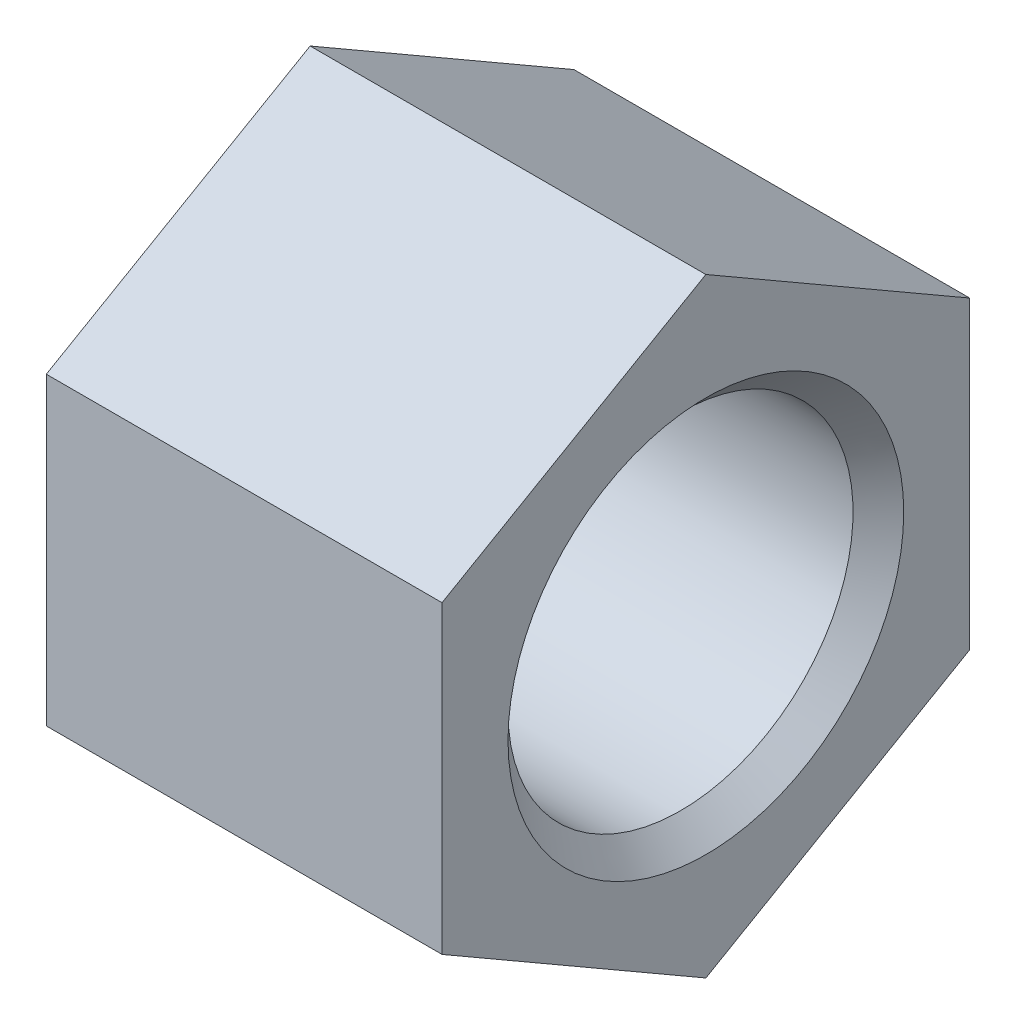
ISO-10303-21;
HEADER;
FILE_DESCRIPTION(('STEP AP214'),'2;1');
FILE_NAME('part.step','',(''),(''),'','','');
FILE_SCHEMA(('AUTOMOTIVE_DESIGN { 1 0 10303 214 1 1 1 1 }'));
ENDSEC;
DATA;
#1=APPLICATION_CONTEXT('core data for automotive mechanical design processes');
#2=APPLICATION_PROTOCOL_DEFINITION('international standard','automotive_design',2000,#1);
#3=PRODUCT_CONTEXT('',#1,'mechanical');
#4=PRODUCT('Part','Part','',(#3));
#5=PRODUCT_RELATED_PRODUCT_CATEGORY('part','',(#4));
#6=PRODUCT_DEFINITION_FORMATION('','',#4);
#7=PRODUCT_DEFINITION_CONTEXT('part definition',#1,'design');
#8=PRODUCT_DEFINITION('design','',#6,#7);
#9=PRODUCT_DEFINITION_SHAPE('','',#8);
#10=(LENGTH_UNIT() NAMED_UNIT(*) SI_UNIT(.MILLI.,.METRE.));
#11=(NAMED_UNIT(*) PLANE_ANGLE_UNIT() SI_UNIT($,.RADIAN.));
#12=(NAMED_UNIT(*) SI_UNIT($,.STERADIAN.) SOLID_ANGLE_UNIT());
#13=UNCERTAINTY_MEASURE_WITH_UNIT(LENGTH_MEASURE(1.E-05),#10,'distance_accuracy_value','');
#14=(GEOMETRIC_REPRESENTATION_CONTEXT(3) GLOBAL_UNCERTAINTY_ASSIGNED_CONTEXT((#13)) GLOBAL_UNIT_ASSIGNED_CONTEXT((#10,
#11,#12)) REPRESENTATION_CONTEXT('',''));
#15=CARTESIAN_POINT('',(0.,0.,0.));
#16=DIRECTION('',(0.,0.,1.));
#17=DIRECTION('',(1.,0.,0.));
#18=AXIS2_PLACEMENT_3D('',#15,#16,#17);
#19=CARTESIAN_POINT('',(0.,19.5,0.));
#20=DIRECTION('',(1.,0.,0.));
#21=DIRECTION('',(0.,0.,-1.));
#22=AXIS2_PLACEMENT_3D('',#19,#20,#21);
#23=PLANE('',#22);
#24=CARTESIAN_POINT('',(0.,0.,0.));
#25=DIRECTION('',(-1.,0.,0.));
#26=DIRECTION('',(0.,0.,1.));
#27=AXIS2_PLACEMENT_3D('',#24,#25,#26);
#28=CIRCLE('',#27,6.5);
#29=CARTESIAN_POINT('',(0.,0.,6.5));
#30=VERTEX_POINT('',#29);
#31=EDGE_CURVE('E157',#30,#30,#28,.T.);
#32=ORIENTED_EDGE('',*,*,#31,.F.);
#33=EDGE_LOOP('',(#32));
#34=FACE_BOUND('',#33,.T.);
#35=DIRECTION('',(0.,-0.5,-0.866025403784439));
#36=VECTOR('',#35,1.);
#37=CARTESIAN_POINT('',(0.,11.5470053837925,-20.));
#38=LINE('',#37,#36);
#39=CARTESIAN_POINT('',(0.,23.094010767585,0.));
#40=VERTEX_POINT('',#39);
#41=CARTESIAN_POINT('',(0.,11.5470053837925,-20.));
#42=VERTEX_POINT('',#41);
#43=EDGE_CURVE('E105',#40,#42,#38,.T.);
#44=ORIENTED_EDGE('',*,*,#43,.T.);
#45=DIRECTION('',(0.,-1.,0.));
#46=VECTOR('',#45,1.);
#47=CARTESIAN_POINT('',(0.,-11.5470053837925,-20.));
#48=LINE('',#47,#46);
#49=CARTESIAN_POINT('',(0.,-11.5470053837925,-20.));
#50=VERTEX_POINT('',#49);
#51=EDGE_CURVE('E219',#42,#50,#48,.T.);
#52=ORIENTED_EDGE('',*,*,#51,.T.);
#53=DIRECTION('',(0.,-0.5,0.866025403784439));
#54=VECTOR('',#53,1.);
#55=CARTESIAN_POINT('',(0.,-23.094010767585,0.));
#56=LINE('',#55,#54);
#57=CARTESIAN_POINT('',(0.,-23.094010767585,0.));
#58=VERTEX_POINT('',#57);
#59=EDGE_CURVE('E221',#50,#58,#56,.T.);
#60=ORIENTED_EDGE('',*,*,#59,.T.);
#61=DIRECTION('',(0.,0.5,0.866025403784439));
#62=VECTOR('',#61,1.);
#63=CARTESIAN_POINT('',(0.,-11.5470053837925,20.));
#64=LINE('',#63,#62);
#65=CARTESIAN_POINT('',(0.,-11.5470053837925,20.));
#66=VERTEX_POINT('',#65);
#67=EDGE_CURVE('E65',#58,#66,#64,.T.);
#68=ORIENTED_EDGE('',*,*,#67,.T.);
#69=DIRECTION('',(0.,1.,0.));
#70=VECTOR('',#69,1.);
#71=CARTESIAN_POINT('',(0.,11.5470053837925,20.));
#72=LINE('',#71,#70);
#73=CARTESIAN_POINT('',(0.,11.5470053837925,20.));
#74=VERTEX_POINT('',#73);
#75=EDGE_CURVE('E136',#66,#74,#72,.T.);
#76=ORIENTED_EDGE('',*,*,#75,.T.);
#77=DIRECTION('',(0.,0.5,-0.866025403784439));
#78=VECTOR('',#77,1.);
#79=CARTESIAN_POINT('',(0.,23.094010767585,0.));
#80=LINE('',#79,#78);
#81=EDGE_CURVE('E148',#74,#40,#80,.T.);
#82=ORIENTED_EDGE('',*,*,#81,.T.);
#83=EDGE_LOOP('',(#44,#52,#60,#68,#76,#82));
#84=FACE_BOUND('',#83,.T.);
#85=ADVANCED_FACE('F49',(#34,#84),#23,.F.);
#86=CARTESIAN_POINT('',(0.,0.,0.));
#87=DIRECTION('',(-1.,0.,0.));
#88=DIRECTION('',(0.,0.,1.));
#89=AXIS2_PLACEMENT_3D('',#86,#87,#88);
#90=CYLINDRICAL_SURFACE('',#89,6.5);
#91=CARTESIAN_POINT('',(5.,0.,0.));
#92=DIRECTION('',(-1.,0.,0.));
#93=DIRECTION('',(0.,0.,1.));
#94=AXIS2_PLACEMENT_3D('',#91,#92,#93);
#95=CIRCLE('',#94,6.5);
#96=CARTESIAN_POINT('',(5.,0.,6.5));
#97=VERTEX_POINT('',#96);
#98=EDGE_CURVE('E154',#97,#97,#95,.T.);
#99=ORIENTED_EDGE('',*,*,#98,.F.);
#100=EDGE_LOOP('',(#99));
#101=FACE_BOUND('',#100,.T.);
#102=ORIENTED_EDGE('',*,*,#31,.T.);
#103=EDGE_LOOP('',(#102));
#104=FACE_BOUND('',#103,.T.);
#105=ADVANCED_FACE('F175',(#101,#104),#90,.F.);
#106=CARTESIAN_POINT('',(5.,6.49999999999999,0.));
#107=DIRECTION('',(-1.,0.,0.));
#108=DIRECTION('',(0.,0.,1.));
#109=AXIS2_PLACEMENT_3D('',#106,#107,#108);
#110=PLANE('',#109);
#111=CARTESIAN_POINT('',(5.,0.,0.));
#112=DIRECTION('',(-1.,0.,0.));
#113=DIRECTION('',(0.,0.,1.));
#114=AXIS2_PLACEMENT_3D('',#111,#112,#113);
#115=CIRCLE('',#114,15.);
#116=CARTESIAN_POINT('',(5.,0.,15.));
#117=VERTEX_POINT('',#116);
#118=EDGE_CURVE('E151',#117,#117,#115,.T.);
#119=ORIENTED_EDGE('',*,*,#118,.F.);
#120=EDGE_LOOP('',(#119));
#121=FACE_BOUND('',#120,.T.);
#122=ORIENTED_EDGE('',*,*,#98,.T.);
#123=EDGE_LOOP('',(#122));
#124=FACE_BOUND('',#123,.T.);
#125=ADVANCED_FACE('F180',(#121,#124),#110,.F.);
#126=CARTESIAN_POINT('',(0.,0.,0.));
#127=DIRECTION('',(-1.,0.,0.));
#128=DIRECTION('',(0.,0.,1.));
#129=AXIS2_PLACEMENT_3D('',#126,#127,#128);
#130=CYLINDRICAL_SURFACE('',#129,15.);
#131=CARTESIAN_POINT('',(9.99999999999999,0.,0.));
#132=DIRECTION('',(-1.,0.,0.));
#133=DIRECTION('',(0.,0.,1.));
#134=AXIS2_PLACEMENT_3D('',#131,#132,#133);
#135=CIRCLE('',#134,15.);
#136=CARTESIAN_POINT('',(9.99999999999999,0.,15.));
#137=VERTEX_POINT('',#136);
#138=EDGE_CURVE('E147',#137,#137,#135,.T.);
#139=ORIENTED_EDGE('',*,*,#138,.F.);
#140=EDGE_LOOP('',(#139));
#141=FACE_BOUND('',#140,.T.);
#142=ORIENTED_EDGE('',*,*,#118,.T.);
#143=EDGE_LOOP('',(#142));
#144=FACE_BOUND('',#143,.T.);
#145=ADVANCED_FACE('F187',(#141,#144),#130,.F.);
#146=CARTESIAN_POINT('',(9.99999999999999,15.,0.));
#147=DIRECTION('',(1.,0.,0.));
#148=DIRECTION('',(0.,0.,-1.));
#149=AXIS2_PLACEMENT_3D('',#146,#147,#148);
#150=PLANE('',#149);
#151=CARTESIAN_POINT('',(9.99999999999999,0.,0.));
#152=DIRECTION('',(-1.,0.,0.));
#153=DIRECTION('',(0.,0.,1.));
#154=AXIS2_PLACEMENT_3D('',#151,#152,#153);
#155=CIRCLE('',#154,13.079);
#156=CARTESIAN_POINT('',(9.99999999999999,0.,13.079));
#157=VERTEX_POINT('',#156);
#158=EDGE_CURVE('E144',#157,#157,#155,.T.);
#159=ORIENTED_EDGE('',*,*,#158,.F.);
#160=EDGE_LOOP('',(#159));
#161=FACE_BOUND('',#160,.T.);
#162=ORIENTED_EDGE('',*,*,#138,.T.);
#163=EDGE_LOOP('',(#162));
#164=FACE_BOUND('',#163,.T.);
#165=ADVANCED_FACE('F191',(#161,#164),#150,.F.);
#166=CARTESIAN_POINT('',(0.,0.,0.));
#167=DIRECTION('',(-1.,0.,0.));
#168=DIRECTION('',(0.,0.,1.));
#169=AXIS2_PLACEMENT_3D('',#166,#167,#168);
#170=CYLINDRICAL_SURFACE('',#169,13.079);
#171=CARTESIAN_POINT('',(28.079,0.,0.));
#172=DIRECTION('',(-1.,0.,0.));
#173=DIRECTION('',(0.,0.,1.));
#174=AXIS2_PLACEMENT_3D('',#171,#172,#173);
#175=CIRCLE('',#174,13.079);
#176=CARTESIAN_POINT('',(28.079,0.,13.079));
#177=VERTEX_POINT('',#176);
#178=EDGE_CURVE('E13',#177,#177,#175,.F.);
#179=ORIENTED_EDGE('',*,*,#178,.T.);
#180=EDGE_LOOP('',(#179));
#181=FACE_BOUND('',#180,.T.);
#182=ORIENTED_EDGE('',*,*,#158,.T.);
#183=EDGE_LOOP('',(#182));
#184=FACE_BOUND('',#183,.T.);
#185=ADVANCED_FACE('F171',(#181,#184),#170,.F.);
#186=CARTESIAN_POINT('',(30.0000000000003,13.079,0.));
#187=DIRECTION('',(-1.,0.,0.));
#188=DIRECTION('',(0.,0.,1.));
#189=AXIS2_PLACEMENT_3D('',#186,#187,#188);
#190=PLANE('',#189);
#191=CARTESIAN_POINT('',(30.,0.,0.));
#192=DIRECTION('',(-1.,0.,0.));
#193=DIRECTION('',(0.,0.,1.));
#194=AXIS2_PLACEMENT_3D('',#191,#192,#193);
#195=CIRCLE('',#194,15.);
#196=CARTESIAN_POINT('',(30.,0.,15.));
#197=VERTEX_POINT('',#196);
#198=EDGE_CURVE('E58',#197,#197,#195,.T.);
#199=ORIENTED_EDGE('',*,*,#198,.T.);
#200=EDGE_LOOP('',(#199));
#201=FACE_BOUND('',#200,.T.);
#202=DIRECTION('',(0.,0.5,0.866025403784439));
#203=VECTOR('',#202,1.);
#204=CARTESIAN_POINT('',(30.0000000000003,11.5470053837925,-20.));
#205=LINE('',#204,#203);
#206=CARTESIAN_POINT('',(30.0000000000003,11.5470053837925,-20.));
#207=VERTEX_POINT('',#206);
#208=CARTESIAN_POINT('',(30.,23.094010767585,0.));
#209=VERTEX_POINT('',#208);
#210=EDGE_CURVE('E103',#207,#209,#205,.T.);
#211=ORIENTED_EDGE('',*,*,#210,.T.);
#212=DIRECTION('',(0.,-0.5,0.866025403784439));
#213=VECTOR('',#212,1.);
#214=CARTESIAN_POINT('',(30.,23.094010767585,0.));
#215=LINE('',#214,#213);
#216=CARTESIAN_POINT('',(30.,11.5470053837925,20.));
#217=VERTEX_POINT('',#216);
#218=EDGE_CURVE('E112',#209,#217,#215,.T.);
#219=ORIENTED_EDGE('',*,*,#218,.T.);
#220=DIRECTION('',(0.,-1.,0.));
#221=VECTOR('',#220,1.);
#222=CARTESIAN_POINT('',(30.,11.5470053837925,20.));
#223=LINE('',#222,#221);
#224=CARTESIAN_POINT('',(30.,-11.5470053837925,20.));
#225=VERTEX_POINT('',#224);
#226=EDGE_CURVE('E118',#217,#225,#223,.T.);
#227=ORIENTED_EDGE('',*,*,#226,.T.);
#228=DIRECTION('',(0.,-0.5,-0.866025403784439));
#229=VECTOR('',#228,1.);
#230=CARTESIAN_POINT('',(30.,-11.5470053837925,20.));
#231=LINE('',#230,#229);
#232=CARTESIAN_POINT('',(30.,-23.094010767585,0.));
#233=VERTEX_POINT('',#232);
#234=EDGE_CURVE('E128',#225,#233,#231,.T.);
#235=ORIENTED_EDGE('',*,*,#234,.T.);
#236=DIRECTION('',(0.,0.5,-0.866025403784439));
#237=VECTOR('',#236,1.);
#238=CARTESIAN_POINT('',(30.,-23.094010767585,0.));
#239=LINE('',#238,#237);
#240=CARTESIAN_POINT('',(30.,-11.5470053837926,-20.0000000000001));
#241=VERTEX_POINT('',#240);
#242=EDGE_CURVE('E131',#233,#241,#239,.T.);
#243=ORIENTED_EDGE('',*,*,#242,.T.);
#244=DIRECTION('',(0.,1.,0.));
#245=VECTOR('',#244,1.);
#246=CARTESIAN_POINT('',(30.,-11.5470053837926,-20.0000000000001));
#247=LINE('',#246,#245);
#248=EDGE_CURVE('E109',#241,#207,#247,.T.);
#249=ORIENTED_EDGE('',*,*,#248,.T.);
#250=EDGE_LOOP('',(#211,#219,#227,#235,#243,#249));
#251=FACE_BOUND('',#250,.T.);
#252=ADVANCED_FACE('F120',(#201,#251),#190,.F.);
#253=CARTESIAN_POINT('',(30.,0.,0.));
#254=DIRECTION('',(1.,0.,0.));
#255=DIRECTION('',(0.,0.,-1.));
#256=AXIS2_PLACEMENT_3D('',#253,#254,#255);
#257=CONICAL_SURFACE('',#256,15.,0.785398163397447);
#258=ORIENTED_EDGE('',*,*,#178,.F.);
#259=EDGE_LOOP('',(#258));
#260=FACE_BOUND('',#259,.T.);
#261=ORIENTED_EDGE('',*,*,#198,.F.);
#262=EDGE_LOOP('',(#261));
#263=FACE_BOUND('',#262,.T.);
#264=ADVANCED_FACE('F51',(#260,#263),#257,.F.);
#265=CARTESIAN_POINT('',(-61.1010092660779,23.094010767585,0.));
#266=DIRECTION('',(0.,0.866025403784439,0.5));
#267=DIRECTION('',(0.,-0.5,0.866025403784439));
#268=AXIS2_PLACEMENT_3D('',#265,#266,#267);
#269=PLANE('',#268);
#270=ORIENTED_EDGE('',*,*,#81,.F.);
#271=DIRECTION('',(1.,0.,0.));
#272=VECTOR('',#271,1.);
#273=CARTESIAN_POINT('',(-61.1010092660779,11.5470053837925,20.));
#274=LINE('',#273,#272);
#275=EDGE_CURVE('E108',#74,#217,#274,.T.);
#276=ORIENTED_EDGE('',*,*,#275,.T.);
#277=ORIENTED_EDGE('',*,*,#218,.F.);
#278=DIRECTION('',(1.,0.,0.));
#279=VECTOR('',#278,1.);
#280=CARTESIAN_POINT('',(-61.1010092660779,23.094010767585,0.));
#281=LINE('',#280,#279);
#282=EDGE_CURVE('E98',#40,#209,#281,.T.);
#283=ORIENTED_EDGE('',*,*,#282,.F.);
#284=EDGE_LOOP('',(#270,#276,#277,#283));
#285=FACE_BOUND('',#284,.T.);
#286=ADVANCED_FACE('F113',(#285),#269,.T.);
#287=CARTESIAN_POINT('',(-61.1010092660779,11.5470053837925,20.));
#288=DIRECTION('',(0.,0.,1.));
#289=DIRECTION('',(1.,0.,0.));
#290=AXIS2_PLACEMENT_3D('',#287,#288,#289);
#291=PLANE('',#290);
#292=ORIENTED_EDGE('',*,*,#75,.F.);
#293=DIRECTION('',(1.,0.,0.));
#294=VECTOR('',#293,1.);
#295=CARTESIAN_POINT('',(-61.1010092660779,-11.5470053837925,20.));
#296=LINE('',#295,#294);
#297=EDGE_CURVE('E141',#66,#225,#296,.T.);
#298=ORIENTED_EDGE('',*,*,#297,.T.);
#299=ORIENTED_EDGE('',*,*,#226,.F.);
#300=ORIENTED_EDGE('',*,*,#275,.F.);
#301=EDGE_LOOP('',(#292,#298,#299,#300));
#302=FACE_BOUND('',#301,.T.);
#303=ADVANCED_FACE('F169',(#302),#291,.T.);
#304=CARTESIAN_POINT('',(-61.1010092660779,-11.5470053837925,20.));
#305=DIRECTION('',(0.,-0.866025403784439,0.5));
#306=DIRECTION('',(0.,-0.5,-0.866025403784439));
#307=AXIS2_PLACEMENT_3D('',#304,#305,#306);
#308=PLANE('',#307);
#309=ORIENTED_EDGE('',*,*,#67,.F.);
#310=DIRECTION('',(1.,0.,0.));
#311=VECTOR('',#310,1.);
#312=CARTESIAN_POINT('',(-61.1010092660779,-23.094010767585,0.));
#313=LINE('',#312,#311);
#314=EDGE_CURVE('E139',#58,#233,#313,.T.);
#315=ORIENTED_EDGE('',*,*,#314,.T.);
#316=ORIENTED_EDGE('',*,*,#234,.F.);
#317=ORIENTED_EDGE('',*,*,#297,.F.);
#318=EDGE_LOOP('',(#309,#315,#316,#317));
#319=FACE_BOUND('',#318,.T.);
#320=ADVANCED_FACE('F204',(#319),#308,.T.);
#321=CARTESIAN_POINT('',(-61.1010092660779,-23.094010767585,0.));
#322=DIRECTION('',(0.,-0.866025403784439,-0.5));
#323=DIRECTION('',(0.,0.5,-0.866025403784439));
#324=AXIS2_PLACEMENT_3D('',#321,#322,#323);
#325=PLANE('',#324);
#326=ORIENTED_EDGE('',*,*,#59,.F.);
#327=DIRECTION('',(1.,0.,0.));
#328=VECTOR('',#327,1.);
#329=CARTESIAN_POINT('',(-61.1010092660779,-11.5470053837925,-20.));
#330=LINE('',#329,#328);
#331=EDGE_CURVE('E137',#50,#241,#330,.T.);
#332=ORIENTED_EDGE('',*,*,#331,.T.);
#333=ORIENTED_EDGE('',*,*,#242,.F.);
#334=ORIENTED_EDGE('',*,*,#314,.F.);
#335=EDGE_LOOP('',(#326,#332,#333,#334));
#336=FACE_BOUND('',#335,.T.);
#337=ADVANCED_FACE('F208',(#336),#325,.T.);
#338=CARTESIAN_POINT('',(-61.1010092660779,-11.5470053837925,-20.));
#339=DIRECTION('',(0.,0.,-1.));
#340=DIRECTION('',(0.,1.,0.));
#341=AXIS2_PLACEMENT_3D('',#338,#339,#340);
#342=PLANE('',#341);
#343=ORIENTED_EDGE('',*,*,#51,.F.);
#344=DIRECTION('',(1.,0.,0.));
#345=VECTOR('',#344,1.);
#346=CARTESIAN_POINT('',(-61.1010092660779,11.5470053837925,-20.));
#347=LINE('',#346,#345);
#348=EDGE_CURVE('E134',#42,#207,#347,.T.);
#349=ORIENTED_EDGE('',*,*,#348,.T.);
#350=ORIENTED_EDGE('',*,*,#248,.F.);
#351=ORIENTED_EDGE('',*,*,#331,.F.);
#352=EDGE_LOOP('',(#343,#349,#350,#351));
#353=FACE_BOUND('',#352,.T.);
#354=ADVANCED_FACE('F200',(#353),#342,.T.);
#355=CARTESIAN_POINT('',(-61.1010092660779,11.5470053837925,-20.));
#356=DIRECTION('',(0.,0.866025403784439,-0.5));
#357=DIRECTION('',(0.,0.5,0.866025403784439));
#358=AXIS2_PLACEMENT_3D('',#355,#356,#357);
#359=PLANE('',#358);
#360=ORIENTED_EDGE('',*,*,#43,.F.);
#361=ORIENTED_EDGE('',*,*,#282,.T.);
#362=ORIENTED_EDGE('',*,*,#210,.F.);
#363=ORIENTED_EDGE('',*,*,#348,.F.);
#364=EDGE_LOOP('',(#360,#361,#362,#363));
#365=FACE_BOUND('',#364,.T.);
#366=ADVANCED_FACE('F100',(#365),#359,.T.);
#367=CLOSED_SHELL('',(#85,#105,#125,#145,#165,#185,#252,#264,#286,#303,#320,#337,#354,#366));
#368=MANIFOLD_SOLID_BREP('B2',#367);
#369=ADVANCED_BREP_SHAPE_REPRESENTATION('',(#18,#368),#14);
#370=SHAPE_DEFINITION_REPRESENTATION(#9,#369);
ENDSEC;
END-ISO-10303-21;
